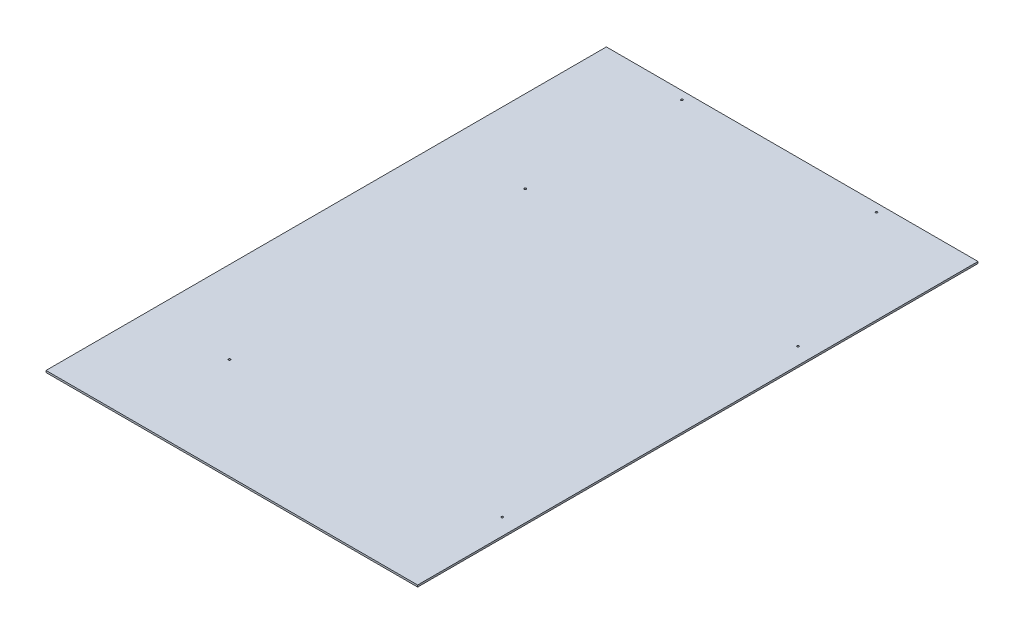
ISO-10303-21;
HEADER;
FILE_DESCRIPTION(('STEP AP214'),'2;1');
FILE_NAME('part.step','',(''),(''),'','','');
FILE_SCHEMA(('AUTOMOTIVE_DESIGN { 1 0 10303 214 1 1 1 1 }'));
ENDSEC;
DATA;
#1=APPLICATION_CONTEXT('core data for automotive mechanical design processes');
#2=APPLICATION_PROTOCOL_DEFINITION('international standard','automotive_design',2000,#1);
#3=PRODUCT_CONTEXT('',#1,'mechanical');
#4=PRODUCT('Part','Part','',(#3));
#5=PRODUCT_RELATED_PRODUCT_CATEGORY('part','',(#4));
#6=PRODUCT_DEFINITION_FORMATION('','',#4);
#7=PRODUCT_DEFINITION_CONTEXT('part definition',#1,'design');
#8=PRODUCT_DEFINITION('design','',#6,#7);
#9=PRODUCT_DEFINITION_SHAPE('','',#8);
#10=(LENGTH_UNIT() NAMED_UNIT(*) SI_UNIT(.MILLI.,.METRE.));
#11=(NAMED_UNIT(*) PLANE_ANGLE_UNIT() SI_UNIT($,.RADIAN.));
#12=(NAMED_UNIT(*) SI_UNIT($,.STERADIAN.) SOLID_ANGLE_UNIT());
#13=UNCERTAINTY_MEASURE_WITH_UNIT(LENGTH_MEASURE(1.E-05),#10,'distance_accuracy_value','');
#14=(GEOMETRIC_REPRESENTATION_CONTEXT(3) GLOBAL_UNCERTAINTY_ASSIGNED_CONTEXT((#13)) GLOBAL_UNIT_ASSIGNED_CONTEXT((#10,
#11,#12)) REPRESENTATION_CONTEXT('',''));
#15=CARTESIAN_POINT('',(0.,0.,0.));
#16=DIRECTION('',(0.,0.,1.));
#17=DIRECTION('',(1.,0.,0.));
#18=AXIS2_PLACEMENT_3D('',#15,#16,#17);
#19=CARTESIAN_POINT('',(-303.2125,0.,-457.2));
#20=DIRECTION('',(0.,0.,1.));
#21=DIRECTION('',(1.,0.,0.));
#22=AXIS2_PLACEMENT_3D('',#19,#20,#21);
#23=PLANE('',#22);
#24=DIRECTION('',(0.,-1.,0.));
#25=VECTOR('',#24,1.);
#26=CARTESIAN_POINT('',(303.2125,1.5,-457.2));
#27=LINE('',#26,#25);
#28=CARTESIAN_POINT('',(303.2125,3.,-457.2));
#29=VERTEX_POINT('',#28);
#30=CARTESIAN_POINT('',(303.2125,0.,-457.2));
#31=VERTEX_POINT('',#30);
#32=EDGE_CURVE('E55',#29,#31,#27,.T.);
#33=ORIENTED_EDGE('',*,*,#32,.T.);
#34=DIRECTION('',(-1.,0.,0.));
#35=VECTOR('',#34,1.);
#36=CARTESIAN_POINT('',(0.,0.,-457.2));
#37=LINE('',#36,#35);
#38=CARTESIAN_POINT('',(-303.2125,0.,-457.2));
#39=VERTEX_POINT('',#38);
#40=EDGE_CURVE('E71',#31,#39,#37,.T.);
#41=ORIENTED_EDGE('',*,*,#40,.T.);
#42=DIRECTION('',(0.,-1.,0.));
#43=VECTOR('',#42,1.);
#44=CARTESIAN_POINT('',(-303.2125,1.5,-457.2));
#45=LINE('',#44,#43);
#46=CARTESIAN_POINT('',(-303.2125,3.,-457.2));
#47=VERTEX_POINT('',#46);
#48=EDGE_CURVE('E70',#47,#39,#45,.T.);
#49=ORIENTED_EDGE('',*,*,#48,.F.);
#50=DIRECTION('',(-1.,0.,0.));
#51=VECTOR('',#50,1.);
#52=CARTESIAN_POINT('',(0.,3.,-457.2));
#53=LINE('',#52,#51);
#54=EDGE_CURVE('E60',#29,#47,#53,.T.);
#55=ORIENTED_EDGE('',*,*,#54,.F.);
#56=EDGE_LOOP('',(#33,#41,#49,#55));
#57=FACE_BOUND('',#56,.T.);
#58=ADVANCED_FACE('F17',(#57),#23,.F.);
#59=CARTESIAN_POINT('',(-303.2125,0.,-457.2));
#60=DIRECTION('',(-1.,0.,0.));
#61=DIRECTION('',(0.,0.,1.));
#62=AXIS2_PLACEMENT_3D('',#59,#60,#61);
#63=PLANE('',#62);
#64=DIRECTION('',(0.,-1.,0.));
#65=VECTOR('',#64,1.);
#66=CARTESIAN_POINT('',(-303.2125,1.5,457.2));
#67=LINE('',#66,#65);
#68=CARTESIAN_POINT('',(-303.2125,3.,457.2));
#69=VERTEX_POINT('',#68);
#70=CARTESIAN_POINT('',(-303.2125,0.,457.2));
#71=VERTEX_POINT('',#70);
#72=EDGE_CURVE('E75',#69,#71,#67,.T.);
#73=ORIENTED_EDGE('',*,*,#72,.F.);
#74=DIRECTION('',(0.,0.,1.));
#75=VECTOR('',#74,1.);
#76=CARTESIAN_POINT('',(-303.2125,3.,0.));
#77=LINE('',#76,#75);
#78=EDGE_CURVE('E64',#47,#69,#77,.T.);
#79=ORIENTED_EDGE('',*,*,#78,.F.);
#80=ORIENTED_EDGE('',*,*,#48,.T.);
#81=DIRECTION('',(0.,0.,1.));
#82=VECTOR('',#81,1.);
#83=CARTESIAN_POINT('',(-303.2125,0.,0.));
#84=LINE('',#83,#82);
#85=EDGE_CURVE('E122',#39,#71,#84,.T.);
#86=ORIENTED_EDGE('',*,*,#85,.T.);
#87=EDGE_LOOP('',(#73,#79,#80,#86));
#88=FACE_BOUND('',#87,.T.);
#89=ADVANCED_FACE('F77',(#88),#63,.T.);
#90=CARTESIAN_POINT('',(-303.2125,0.,457.2));
#91=DIRECTION('',(0.,0.,1.));
#92=DIRECTION('',(1.,0.,0.));
#93=AXIS2_PLACEMENT_3D('',#90,#91,#92);
#94=PLANE('',#93);
#95=DIRECTION('',(0.,1.,0.));
#96=VECTOR('',#95,1.);
#97=CARTESIAN_POINT('',(303.2125,1.5,457.2));
#98=LINE('',#97,#96);
#99=CARTESIAN_POINT('',(303.2125,0.,457.2));
#100=VERTEX_POINT('',#99);
#101=CARTESIAN_POINT('',(303.2125,3.,457.2));
#102=VERTEX_POINT('',#101);
#103=EDGE_CURVE('E36',#100,#102,#98,.T.);
#104=ORIENTED_EDGE('',*,*,#103,.T.);
#105=DIRECTION('',(1.,0.,0.));
#106=VECTOR('',#105,1.);
#107=CARTESIAN_POINT('',(0.,3.,457.2));
#108=LINE('',#107,#106);
#109=EDGE_CURVE('E79',#69,#102,#108,.T.);
#110=ORIENTED_EDGE('',*,*,#109,.F.);
#111=ORIENTED_EDGE('',*,*,#72,.T.);
#112=DIRECTION('',(1.,0.,0.));
#113=VECTOR('',#112,1.);
#114=CARTESIAN_POINT('',(0.,0.,457.2));
#115=LINE('',#114,#113);
#116=EDGE_CURVE('E124',#71,#100,#115,.T.);
#117=ORIENTED_EDGE('',*,*,#116,.T.);
#118=EDGE_LOOP('',(#104,#110,#111,#117));
#119=FACE_BOUND('',#118,.T.);
#120=ADVANCED_FACE('F131',(#119),#94,.T.);
#121=CARTESIAN_POINT('',(303.2125,0.,-457.2));
#122=DIRECTION('',(-1.,0.,0.));
#123=DIRECTION('',(0.,0.,1.));
#124=AXIS2_PLACEMENT_3D('',#121,#122,#123);
#125=PLANE('',#124);
#126=ORIENTED_EDGE('',*,*,#103,.F.);
#127=DIRECTION('',(0.,0.,-1.));
#128=VECTOR('',#127,1.);
#129=CARTESIAN_POINT('',(303.2125,0.,0.));
#130=LINE('',#129,#128);
#131=EDGE_CURVE('E104',#100,#31,#130,.T.);
#132=ORIENTED_EDGE('',*,*,#131,.T.);
#133=ORIENTED_EDGE('',*,*,#32,.F.);
#134=DIRECTION('',(0.,0.,-1.));
#135=VECTOR('',#134,1.);
#136=CARTESIAN_POINT('',(303.2125,3.,0.));
#137=LINE('',#136,#135);
#138=EDGE_CURVE('E66',#102,#29,#137,.T.);
#139=ORIENTED_EDGE('',*,*,#138,.F.);
#140=EDGE_LOOP('',(#126,#132,#133,#139));
#141=FACE_BOUND('',#140,.T.);
#142=ADVANCED_FACE('F127',(#141),#125,.F.);
#143=CARTESIAN_POINT('',(-168.9735,3.,-190.5));
#144=DIRECTION('',(0.,-1.,0.));
#145=DIRECTION('',(0.,0.,-1.));
#146=AXIS2_PLACEMENT_3D('',#143,#144,#145);
#147=CYLINDRICAL_SURFACE('',#146,1.6256);
#148=CARTESIAN_POINT('',(-168.9735,0.,-190.5));
#149=DIRECTION('',(0.,-1.,0.));
#150=DIRECTION('',(0.,0.,-1.));
#151=AXIS2_PLACEMENT_3D('',#148,#149,#150);
#152=CIRCLE('',#151,1.6256);
#153=CARTESIAN_POINT('',(-168.9735,0.,-192.1256));
#154=VERTEX_POINT('',#153);
#155=EDGE_CURVE('E101',#154,#154,#152,.T.);
#156=ORIENTED_EDGE('',*,*,#155,.T.);
#157=EDGE_LOOP('',(#156));
#158=FACE_BOUND('',#157,.T.);
#159=CARTESIAN_POINT('',(-168.9735,3.,-190.5));
#160=DIRECTION('',(0.,-1.,0.));
#161=DIRECTION('',(0.,0.,-1.));
#162=AXIS2_PLACEMENT_3D('',#159,#160,#161);
#163=CIRCLE('',#162,1.6256);
#164=CARTESIAN_POINT('',(-168.9735,3.,-192.1256));
#165=VERTEX_POINT('',#164);
#166=EDGE_CURVE('E21',#165,#165,#163,.T.);
#167=ORIENTED_EDGE('',*,*,#166,.F.);
#168=EDGE_LOOP('',(#167));
#169=FACE_BOUND('',#168,.T.);
#170=ADVANCED_FACE('F139',(#158,#169),#147,.F.);
#171=CARTESIAN_POINT('',(276.2265,3.,292.1));
#172=DIRECTION('',(0.,-1.,0.));
#173=DIRECTION('',(0.,0.,-1.));
#174=AXIS2_PLACEMENT_3D('',#171,#172,#173);
#175=CYLINDRICAL_SURFACE('',#174,1.6256);
#176=CARTESIAN_POINT('',(276.2265,0.,292.1));
#177=DIRECTION('',(0.,-1.,0.));
#178=DIRECTION('',(0.,0.,-1.));
#179=AXIS2_PLACEMENT_3D('',#176,#177,#178);
#180=CIRCLE('',#179,1.6256);
#181=CARTESIAN_POINT('',(276.2265,0.,290.4744));
#182=VERTEX_POINT('',#181);
#183=EDGE_CURVE('E98',#182,#182,#180,.T.);
#184=ORIENTED_EDGE('',*,*,#183,.T.);
#185=EDGE_LOOP('',(#184));
#186=FACE_BOUND('',#185,.T.);
#187=CARTESIAN_POINT('',(276.2265,3.,292.1));
#188=DIRECTION('',(0.,-1.,0.));
#189=DIRECTION('',(0.,0.,-1.));
#190=AXIS2_PLACEMENT_3D('',#187,#188,#189);
#191=CIRCLE('',#190,1.6256);
#192=CARTESIAN_POINT('',(276.2265,3.,290.4744));
#193=VERTEX_POINT('',#192);
#194=EDGE_CURVE('E113',#193,#193,#191,.T.);
#195=ORIENTED_EDGE('',*,*,#194,.F.);
#196=EDGE_LOOP('',(#195));
#197=FACE_BOUND('',#196,.T.);
#198=ADVANCED_FACE('F163',(#186,#197),#175,.F.);
#199=CARTESIAN_POINT('',(276.2265,3.,-190.5));
#200=DIRECTION('',(0.,-1.,0.));
#201=DIRECTION('',(0.,0.,-1.));
#202=AXIS2_PLACEMENT_3D('',#199,#200,#201);
#203=CYLINDRICAL_SURFACE('',#202,1.6256);
#204=CARTESIAN_POINT('',(276.2265,0.,-190.5));
#205=DIRECTION('',(0.,-1.,0.));
#206=DIRECTION('',(0.,0.,-1.));
#207=AXIS2_PLACEMENT_3D('',#204,#205,#206);
#208=CIRCLE('',#207,1.6256);
#209=CARTESIAN_POINT('',(276.2265,0.,-192.1256));
#210=VERTEX_POINT('',#209);
#211=EDGE_CURVE('E95',#210,#210,#208,.T.);
#212=ORIENTED_EDGE('',*,*,#211,.T.);
#213=EDGE_LOOP('',(#212));
#214=FACE_BOUND('',#213,.T.);
#215=CARTESIAN_POINT('',(276.2265,3.,-190.5));
#216=DIRECTION('',(0.,-1.,0.));
#217=DIRECTION('',(0.,0.,-1.));
#218=AXIS2_PLACEMENT_3D('',#215,#216,#217);
#219=CIRCLE('',#218,1.6256);
#220=CARTESIAN_POINT('',(276.2265,3.,-192.1256));
#221=VERTEX_POINT('',#220);
#222=EDGE_CURVE('E111',#221,#221,#219,.T.);
#223=ORIENTED_EDGE('',*,*,#222,.F.);
#224=EDGE_LOOP('',(#223));
#225=FACE_BOUND('',#224,.T.);
#226=ADVANCED_FACE('F159',(#214,#225),#203,.F.);
#227=CARTESIAN_POINT('',(150.8125,3.,-443.992));
#228=DIRECTION('',(0.,-1.,0.));
#229=DIRECTION('',(0.,0.,-1.));
#230=AXIS2_PLACEMENT_3D('',#227,#228,#229);
#231=CYLINDRICAL_SURFACE('',#230,1.62560000000006);
#232=CARTESIAN_POINT('',(150.8125,0.,-443.992));
#233=DIRECTION('',(0.,-1.,0.));
#234=DIRECTION('',(0.,0.,-1.));
#235=AXIS2_PLACEMENT_3D('',#232,#233,#234);
#236=CIRCLE('',#235,1.62560000000006);
#237=CARTESIAN_POINT('',(150.8125,0.,-445.6176));
#238=VERTEX_POINT('',#237);
#239=EDGE_CURVE('E92',#238,#238,#236,.T.);
#240=ORIENTED_EDGE('',*,*,#239,.T.);
#241=EDGE_LOOP('',(#240));
#242=FACE_BOUND('',#241,.T.);
#243=CARTESIAN_POINT('',(150.8125,3.,-443.992));
#244=DIRECTION('',(0.,-1.,0.));
#245=DIRECTION('',(0.,0.,-1.));
#246=AXIS2_PLACEMENT_3D('',#243,#244,#245);
#247=CIRCLE('',#246,1.62560000000006);
#248=CARTESIAN_POINT('',(150.8125,3.,-445.6176));
#249=VERTEX_POINT('',#248);
#250=EDGE_CURVE('E108',#249,#249,#247,.T.);
#251=ORIENTED_EDGE('',*,*,#250,.F.);
#252=EDGE_LOOP('',(#251));
#253=FACE_BOUND('',#252,.T.);
#254=ADVANCED_FACE('F155',(#242,#253),#231,.F.);
#255=CARTESIAN_POINT('',(-166.6875,3.,-443.992));
#256=DIRECTION('',(0.,-1.,0.));
#257=DIRECTION('',(0.,0.,-1.));
#258=AXIS2_PLACEMENT_3D('',#255,#256,#257);
#259=CYLINDRICAL_SURFACE('',#258,1.62560000000006);
#260=CARTESIAN_POINT('',(-166.6875,0.,-443.992));
#261=DIRECTION('',(0.,-1.,0.));
#262=DIRECTION('',(0.,0.,-1.));
#263=AXIS2_PLACEMENT_3D('',#260,#261,#262);
#264=CIRCLE('',#263,1.62560000000006);
#265=CARTESIAN_POINT('',(-166.6875,0.,-445.6176));
#266=VERTEX_POINT('',#265);
#267=EDGE_CURVE('E89',#266,#266,#264,.T.);
#268=ORIENTED_EDGE('',*,*,#267,.T.);
#269=EDGE_LOOP('',(#268));
#270=FACE_BOUND('',#269,.T.);
#271=CARTESIAN_POINT('',(-166.6875,3.,-443.992));
#272=DIRECTION('',(0.,-1.,0.));
#273=DIRECTION('',(0.,0.,-1.));
#274=AXIS2_PLACEMENT_3D('',#271,#272,#273);
#275=CIRCLE('',#274,1.62560000000006);
#276=CARTESIAN_POINT('',(-166.6875,3.,-445.6176));
#277=VERTEX_POINT('',#276);
#278=EDGE_CURVE('E105',#277,#277,#275,.T.);
#279=ORIENTED_EDGE('',*,*,#278,.F.);
#280=EDGE_LOOP('',(#279));
#281=FACE_BOUND('',#280,.T.);
#282=ADVANCED_FACE('F152',(#270,#281),#259,.F.);
#283=CARTESIAN_POINT('',(-303.2125,3.,-457.2));
#284=DIRECTION('',(0.,1.,0.));
#285=DIRECTION('',(0.,0.,1.));
#286=AXIS2_PLACEMENT_3D('',#283,#284,#285);
#287=PLANE('',#286);
#288=ORIENTED_EDGE('',*,*,#278,.T.);
#289=EDGE_LOOP('',(#288));
#290=FACE_BOUND('',#289,.T.);
#291=ORIENTED_EDGE('',*,*,#250,.T.);
#292=EDGE_LOOP('',(#291));
#293=FACE_BOUND('',#292,.T.);
#294=ORIENTED_EDGE('',*,*,#222,.T.);
#295=EDGE_LOOP('',(#294));
#296=FACE_BOUND('',#295,.T.);
#297=ORIENTED_EDGE('',*,*,#194,.T.);
#298=EDGE_LOOP('',(#297));
#299=FACE_BOUND('',#298,.T.);
#300=ORIENTED_EDGE('',*,*,#166,.T.);
#301=EDGE_LOOP('',(#300));
#302=FACE_BOUND('',#301,.T.);
#303=CARTESIAN_POINT('',(-168.9735,3.,292.1));
#304=DIRECTION('',(0.,-1.,0.));
#305=DIRECTION('',(0.,0.,-1.));
#306=AXIS2_PLACEMENT_3D('',#303,#304,#305);
#307=CIRCLE('',#306,1.6256);
#308=CARTESIAN_POINT('',(-168.9735,3.,290.4744));
#309=VERTEX_POINT('',#308);
#310=EDGE_CURVE('E27',#309,#309,#307,.F.);
#311=ORIENTED_EDGE('',*,*,#310,.F.);
#312=EDGE_LOOP('',(#311));
#313=FACE_BOUND('',#312,.T.);
#314=ORIENTED_EDGE('',*,*,#109,.T.);
#315=ORIENTED_EDGE('',*,*,#138,.T.);
#316=ORIENTED_EDGE('',*,*,#54,.T.);
#317=ORIENTED_EDGE('',*,*,#78,.T.);
#318=EDGE_LOOP('',(#314,#315,#316,#317));
#319=FACE_BOUND('',#318,.T.);
#320=ADVANCED_FACE('F62',(#290,#293,#296,#299,#302,#313,#319),#287,.T.);
#321=CARTESIAN_POINT('',(-303.2125,0.,-457.2));
#322=DIRECTION('',(0.,1.,0.));
#323=DIRECTION('',(0.,0.,1.));
#324=AXIS2_PLACEMENT_3D('',#321,#322,#323);
#325=PLANE('',#324);
#326=ORIENTED_EDGE('',*,*,#267,.F.);
#327=EDGE_LOOP('',(#326));
#328=FACE_BOUND('',#327,.T.);
#329=ORIENTED_EDGE('',*,*,#239,.F.);
#330=EDGE_LOOP('',(#329));
#331=FACE_BOUND('',#330,.T.);
#332=ORIENTED_EDGE('',*,*,#211,.F.);
#333=EDGE_LOOP('',(#332));
#334=FACE_BOUND('',#333,.T.);
#335=ORIENTED_EDGE('',*,*,#183,.F.);
#336=EDGE_LOOP('',(#335));
#337=FACE_BOUND('',#336,.T.);
#338=ORIENTED_EDGE('',*,*,#155,.F.);
#339=EDGE_LOOP('',(#338));
#340=FACE_BOUND('',#339,.T.);
#341=CARTESIAN_POINT('',(-168.9735,0.,292.1));
#342=DIRECTION('',(0.,-1.,0.));
#343=DIRECTION('',(0.,0.,-1.));
#344=AXIS2_PLACEMENT_3D('',#341,#342,#343);
#345=CIRCLE('',#344,1.6256);
#346=CARTESIAN_POINT('',(-168.9735,0.,290.4744));
#347=VERTEX_POINT('',#346);
#348=EDGE_CURVE('E11',#347,#347,#345,.T.);
#349=ORIENTED_EDGE('',*,*,#348,.F.);
#350=EDGE_LOOP('',(#349));
#351=FACE_BOUND('',#350,.T.);
#352=ORIENTED_EDGE('',*,*,#116,.F.);
#353=ORIENTED_EDGE('',*,*,#85,.F.);
#354=ORIENTED_EDGE('',*,*,#40,.F.);
#355=ORIENTED_EDGE('',*,*,#131,.F.);
#356=EDGE_LOOP('',(#352,#353,#354,#355));
#357=FACE_BOUND('',#356,.T.);
#358=ADVANCED_FACE('F19',(#328,#331,#334,#337,#340,#351,#357),#325,.F.);
#359=CARTESIAN_POINT('',(-168.9735,3.,292.1));
#360=DIRECTION('',(0.,-1.,0.));
#361=DIRECTION('',(0.,0.,-1.));
#362=AXIS2_PLACEMENT_3D('',#359,#360,#361);
#363=CYLINDRICAL_SURFACE('',#362,1.6256);
#364=ORIENTED_EDGE('',*,*,#348,.T.);
#365=EDGE_LOOP('',(#364));
#366=FACE_BOUND('',#365,.T.);
#367=ORIENTED_EDGE('',*,*,#310,.T.);
#368=EDGE_LOOP('',(#367));
#369=FACE_BOUND('',#368,.T.);
#370=ADVANCED_FACE('F142',(#366,#369),#363,.F.);
#371=CLOSED_SHELL('',(#58,#89,#120,#142,#170,#198,#226,#254,#282,#320,#358,#370));
#372=MANIFOLD_SOLID_BREP('B1',#371);
#373=ADVANCED_BREP_SHAPE_REPRESENTATION('',(#18,#372),#14);
#374=SHAPE_DEFINITION_REPRESENTATION(#9,#373);
ENDSEC;
END-ISO-10303-21;
